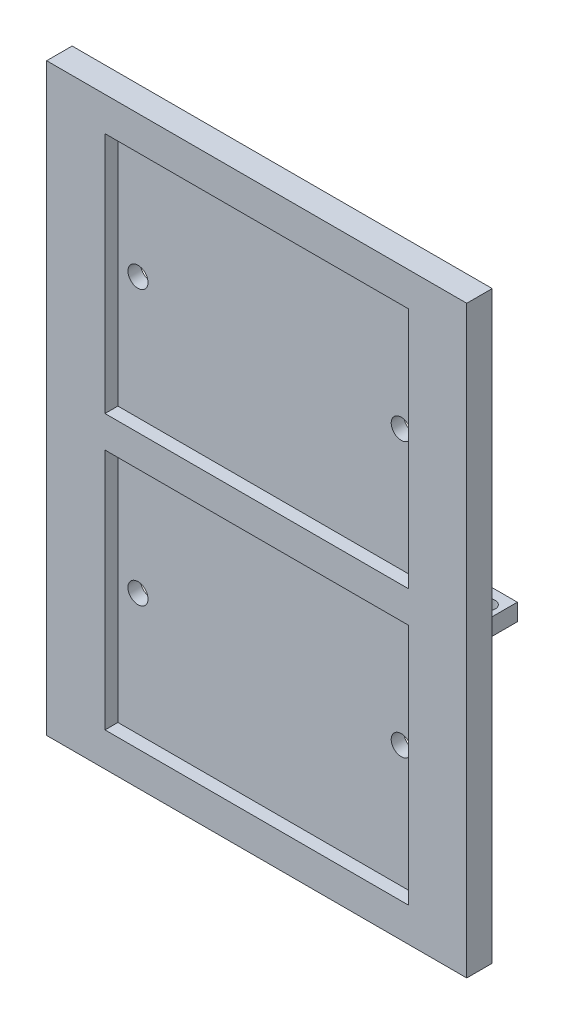
ISO-10303-21;
HEADER;
FILE_DESCRIPTION(('STEP AP214'),'2;1');
FILE_NAME('part.step','',(''),(''),'','','');
FILE_SCHEMA(('AUTOMOTIVE_DESIGN { 1 0 10303 214 1 1 1 1 }'));
ENDSEC;
DATA;
#1=APPLICATION_CONTEXT('core data for automotive mechanical design processes');
#2=APPLICATION_PROTOCOL_DEFINITION('international standard','automotive_design',2000,#1);
#3=PRODUCT_CONTEXT('',#1,'mechanical');
#4=PRODUCT('Part','Part','',(#3));
#5=PRODUCT_RELATED_PRODUCT_CATEGORY('part','',(#4));
#6=PRODUCT_DEFINITION_FORMATION('','',#4);
#7=PRODUCT_DEFINITION_CONTEXT('part definition',#1,'design');
#8=PRODUCT_DEFINITION('design','',#6,#7);
#9=PRODUCT_DEFINITION_SHAPE('','',#8);
#10=(LENGTH_UNIT() NAMED_UNIT(*) SI_UNIT(.MILLI.,.METRE.));
#11=(NAMED_UNIT(*) PLANE_ANGLE_UNIT() SI_UNIT($,.RADIAN.));
#12=(NAMED_UNIT(*) SI_UNIT($,.STERADIAN.) SOLID_ANGLE_UNIT());
#13=UNCERTAINTY_MEASURE_WITH_UNIT(LENGTH_MEASURE(1.E-05),#10,'distance_accuracy_value','');
#14=(GEOMETRIC_REPRESENTATION_CONTEXT(3) GLOBAL_UNCERTAINTY_ASSIGNED_CONTEXT((#13)) GLOBAL_UNIT_ASSIGNED_CONTEXT((#10,
#11,#12)) REPRESENTATION_CONTEXT('',''));
#15=CARTESIAN_POINT('',(0.,0.,0.));
#16=DIRECTION('',(0.,0.,1.));
#17=DIRECTION('',(1.,0.,0.));
#18=AXIS2_PLACEMENT_3D('',#15,#16,#17);
#19=CARTESIAN_POINT('',(0.,0.,-3.81));
#20=DIRECTION('',(0.,0.,1.));
#21=DIRECTION('',(1.,0.,0.));
#22=AXIS2_PLACEMENT_3D('',#19,#20,#21);
#23=PLANE('',#22);
#24=CARTESIAN_POINT('',(19.6822,20.608,-3.81));
#25=DIRECTION('',(0.,0.,1.));
#26=DIRECTION('',(1.,0.,0.));
#27=AXIS2_PLACEMENT_3D('',#24,#25,#26);
#28=CIRCLE('',#27,1.5);
#29=CARTESIAN_POINT('',(21.1822,20.608,-3.81));
#30=VERTEX_POINT('',#29);
#31=EDGE_CURVE('E715',#30,#30,#28,.T.);
#32=ORIENTED_EDGE('',*,*,#31,.T.);
#33=EDGE_LOOP('',(#32));
#34=FACE_BOUND('',#33,.T.);
#35=CARTESIAN_POINT('',(-19.6822,-20.3622,-3.81));
#36=DIRECTION('',(0.,0.,1.));
#37=DIRECTION('',(1.,0.,0.));
#38=AXIS2_PLACEMENT_3D('',#35,#36,#37);
#39=CIRCLE('',#38,1.5);
#40=CARTESIAN_POINT('',(-18.1822,-20.3622,-3.81));
#41=VERTEX_POINT('',#40);
#42=EDGE_CURVE('E207',#41,#41,#39,.T.);
#43=ORIENTED_EDGE('',*,*,#42,.T.);
#44=EDGE_LOOP('',(#43));
#45=FACE_BOUND('',#44,.T.);
#46=CARTESIAN_POINT('',(-19.6822,20.608,-3.81));
#47=DIRECTION('',(0.,0.,1.));
#48=DIRECTION('',(1.,0.,0.));
#49=AXIS2_PLACEMENT_3D('',#46,#47,#48);
#50=CIRCLE('',#49,1.5);
#51=CARTESIAN_POINT('',(-18.1822,20.608,-3.81));
#52=VERTEX_POINT('',#51);
#53=EDGE_CURVE('E719',#52,#52,#50,.T.);
#54=ORIENTED_EDGE('',*,*,#53,.T.);
#55=EDGE_LOOP('',(#54));
#56=FACE_BOUND('',#55,.T.);
#57=CARTESIAN_POINT('',(19.6822,-20.3622,-3.81));
#58=DIRECTION('',(0.,0.,1.));
#59=DIRECTION('',(1.,0.,0.));
#60=AXIS2_PLACEMENT_3D('',#57,#58,#59);
#61=CIRCLE('',#60,1.5);
#62=CARTESIAN_POINT('',(21.1822,-20.3622,-3.81));
#63=VERTEX_POINT('',#62);
#64=EDGE_CURVE('E712',#63,#63,#61,.T.);
#65=ORIENTED_EDGE('',*,*,#64,.T.);
#66=EDGE_LOOP('',(#65));
#67=FACE_BOUND('',#66,.T.);
#68=DIRECTION('',(0.,-1.,0.));
#69=VECTOR('',#68,1.);
#70=CARTESIAN_POINT('',(30.0853602,-0.126999999999988,-3.81));
#71=LINE('',#70,#69);
#72=CARTESIAN_POINT('',(30.0853602,-0.126999999999988,-3.81));
#73=VERTEX_POINT('',#72);
#74=CARTESIAN_POINT('',(30.0853602,-2.66699999999999,-3.81));
#75=VERTEX_POINT('',#74);
#76=EDGE_CURVE('E329',#73,#75,#71,.T.);
#77=ORIENTED_EDGE('',*,*,#76,.F.);
#78=DIRECTION('',(1.,0.,0.));
#79=VECTOR('',#78,1.);
#80=CARTESIAN_POINT('',(30.0853602,-0.126999999999988,-3.81));
#81=LINE('',#80,#79);
#82=CARTESIAN_POINT('',(26.2753602,-0.126999999999988,-3.81));
#83=VERTEX_POINT('',#82);
#84=EDGE_CURVE('E335',#83,#73,#81,.T.);
#85=ORIENTED_EDGE('',*,*,#84,.F.);
#86=DIRECTION('',(0.,1.,0.));
#87=VECTOR('',#86,1.);
#88=CARTESIAN_POINT('',(26.2753602,-0.126999999999988,-3.81));
#89=LINE('',#88,#87);
#90=CARTESIAN_POINT('',(26.2753602,-2.66699999999999,-3.81));
#91=VERTEX_POINT('',#90);
#92=EDGE_CURVE('E352',#91,#83,#89,.T.);
#93=ORIENTED_EDGE('',*,*,#92,.F.);
#94=DIRECTION('',(-1.,0.,0.));
#95=VECTOR('',#94,1.);
#96=CARTESIAN_POINT('',(30.0853602,-2.66699999999999,-3.81));
#97=LINE('',#96,#95);
#98=EDGE_CURVE('E348',#75,#91,#97,.T.);
#99=ORIENTED_EDGE('',*,*,#98,.F.);
#100=EDGE_LOOP('',(#77,#85,#93,#99));
#101=FACE_BOUND('',#100,.T.);
#102=DIRECTION('',(0.,-1.,0.));
#103=VECTOR('',#102,1.);
#104=CARTESIAN_POINT('',(-31.4071,43.688,-3.81));
#105=LINE('',#104,#103);
#106=CARTESIAN_POINT('',(-31.4071,43.688,-3.81));
#107=VERTEX_POINT('',#106);
#108=CARTESIAN_POINT('',(-31.4071,-43.688,-3.81));
#109=VERTEX_POINT('',#108);
#110=EDGE_CURVE('E375',#107,#109,#105,.T.);
#111=ORIENTED_EDGE('',*,*,#110,.F.);
#112=DIRECTION('',(-1.,0.,0.));
#113=VECTOR('',#112,1.);
#114=CARTESIAN_POINT('',(-31.4071,43.688,-3.81));
#115=LINE('',#114,#113);
#116=CARTESIAN_POINT('',(31.4071,43.688,-3.81));
#117=VERTEX_POINT('',#116);
#118=EDGE_CURVE('E388',#117,#107,#115,.T.);
#119=ORIENTED_EDGE('',*,*,#118,.F.);
#120=DIRECTION('',(0.,1.,0.));
#121=VECTOR('',#120,1.);
#122=CARTESIAN_POINT('',(31.4071,43.688,-3.81));
#123=LINE('',#122,#121);
#124=CARTESIAN_POINT('',(31.4071,-43.688,-3.81));
#125=VERTEX_POINT('',#124);
#126=EDGE_CURVE('E384',#125,#117,#123,.T.);
#127=ORIENTED_EDGE('',*,*,#126,.F.);
#128=DIRECTION('',(1.,0.,0.));
#129=VECTOR('',#128,1.);
#130=CARTESIAN_POINT('',(-31.4071,-43.688,-3.81));
#131=LINE('',#130,#129);
#132=EDGE_CURVE('E379',#109,#125,#131,.T.);
#133=ORIENTED_EDGE('',*,*,#132,.F.);
#134=EDGE_LOOP('',(#111,#119,#127,#133));
#135=FACE_BOUND('',#134,.T.);
#136=DIRECTION('',(0.,1.,0.));
#137=VECTOR('',#136,1.);
#138=CARTESIAN_POINT('',(-30.0853602,-0.126999999999981,-3.81));
#139=LINE('',#138,#137);
#140=CARTESIAN_POINT('',(-30.0853602,-2.66699999999998,-3.81));
#141=VERTEX_POINT('',#140);
#142=CARTESIAN_POINT('',(-30.0853602,-0.126999999999981,-3.81));
#143=VERTEX_POINT('',#142);
#144=EDGE_CURVE('E284',#141,#143,#139,.T.);
#145=ORIENTED_EDGE('',*,*,#144,.F.);
#146=DIRECTION('',(-1.,0.,0.));
#147=VECTOR('',#146,1.);
#148=CARTESIAN_POINT('',(-30.0853602,-2.66699999999998,-3.81));
#149=LINE('',#148,#147);
#150=CARTESIAN_POINT('',(-26.2753602,-2.66699999999998,-3.81));
#151=VERTEX_POINT('',#150);
#152=EDGE_CURVE('E290',#151,#141,#149,.T.);
#153=ORIENTED_EDGE('',*,*,#152,.F.);
#154=DIRECTION('',(0.,-1.,0.));
#155=VECTOR('',#154,1.);
#156=CARTESIAN_POINT('',(-26.2753602,-0.126999999999981,-3.81));
#157=LINE('',#156,#155);
#158=CARTESIAN_POINT('',(-26.2753602,-0.126999999999981,-3.81));
#159=VERTEX_POINT('',#158);
#160=EDGE_CURVE('E307',#159,#151,#157,.T.);
#161=ORIENTED_EDGE('',*,*,#160,.F.);
#162=DIRECTION('',(1.,0.,0.));
#163=VECTOR('',#162,1.);
#164=CARTESIAN_POINT('',(-30.0853602,-0.126999999999981,-3.81));
#165=LINE('',#164,#163);
#166=EDGE_CURVE('E303',#143,#159,#165,.T.);
#167=ORIENTED_EDGE('',*,*,#166,.F.);
#168=EDGE_LOOP('',(#145,#153,#161,#167));
#169=FACE_BOUND('',#168,.T.);
#170=ADVANCED_FACE('F38',(#34,#45,#56,#67,#101,#135,#169),#23,.F.);
#171=CARTESIAN_POINT('',(-31.4071,43.688,-3.81));
#172=DIRECTION('',(-1.,0.,0.));
#173=DIRECTION('',(0.,-1.,0.));
#174=AXIS2_PLACEMENT_3D('',#171,#172,#173);
#175=PLANE('',#174);
#176=DIRECTION('',(0.,-1.,0.));
#177=VECTOR('',#176,1.);
#178=CARTESIAN_POINT('',(-31.4071,43.688,0.));
#179=LINE('',#178,#177);
#180=CARTESIAN_POINT('',(-31.4071,43.688,0.));
#181=VERTEX_POINT('',#180);
#182=CARTESIAN_POINT('',(-31.4071,-43.688,0.));
#183=VERTEX_POINT('',#182);
#184=EDGE_CURVE('E374',#181,#183,#179,.T.);
#185=ORIENTED_EDGE('',*,*,#184,.F.);
#186=DIRECTION('',(0.,0.,1.));
#187=VECTOR('',#186,1.);
#188=CARTESIAN_POINT('',(-31.4071,43.688,-3.81));
#189=LINE('',#188,#187);
#190=EDGE_CURVE('E11',#107,#181,#189,.T.);
#191=ORIENTED_EDGE('',*,*,#190,.F.);
#192=ORIENTED_EDGE('',*,*,#110,.T.);
#193=DIRECTION('',(0.,0.,1.));
#194=VECTOR('',#193,1.);
#195=CARTESIAN_POINT('',(-31.4071,-43.688,-3.81));
#196=LINE('',#195,#194);
#197=EDGE_CURVE('E392',#109,#183,#196,.T.);
#198=ORIENTED_EDGE('',*,*,#197,.T.);
#199=EDGE_LOOP('',(#185,#191,#192,#198));
#200=FACE_BOUND('',#199,.T.);
#201=ADVANCED_FACE('F40',(#200),#175,.T.);
#202=CARTESIAN_POINT('',(-31.4071,43.688,-3.81));
#203=DIRECTION('',(0.,1.,0.));
#204=DIRECTION('',(-1.,0.,0.));
#205=AXIS2_PLACEMENT_3D('',#202,#203,#204);
#206=PLANE('',#205);
#207=DIRECTION('',(-1.,0.,0.));
#208=VECTOR('',#207,1.);
#209=CARTESIAN_POINT('',(-31.4071,43.688,0.));
#210=LINE('',#209,#208);
#211=CARTESIAN_POINT('',(31.4071,43.688,0.));
#212=VERTEX_POINT('',#211);
#213=EDGE_CURVE('E380',#212,#181,#210,.T.);
#214=ORIENTED_EDGE('',*,*,#213,.F.);
#215=DIRECTION('',(0.,0.,1.));
#216=VECTOR('',#215,1.);
#217=CARTESIAN_POINT('',(31.4071,43.688,-3.81));
#218=LINE('',#217,#216);
#219=EDGE_CURVE('E48',#117,#212,#218,.T.);
#220=ORIENTED_EDGE('',*,*,#219,.F.);
#221=ORIENTED_EDGE('',*,*,#118,.T.);
#222=ORIENTED_EDGE('',*,*,#190,.T.);
#223=EDGE_LOOP('',(#214,#220,#221,#222));
#224=FACE_BOUND('',#223,.T.);
#225=ADVANCED_FACE('F424',(#224),#206,.T.);
#226=CARTESIAN_POINT('',(31.4071,43.688,-3.81));
#227=DIRECTION('',(1.,0.,0.));
#228=DIRECTION('',(0.,1.,0.));
#229=AXIS2_PLACEMENT_3D('',#226,#227,#228);
#230=PLANE('',#229);
#231=DIRECTION('',(0.,1.,0.));
#232=VECTOR('',#231,1.);
#233=CARTESIAN_POINT('',(31.4071,43.688,0.));
#234=LINE('',#233,#232);
#235=CARTESIAN_POINT('',(31.4071,-43.688,0.));
#236=VERTEX_POINT('',#235);
#237=EDGE_CURVE('E400',#236,#212,#234,.T.);
#238=ORIENTED_EDGE('',*,*,#237,.F.);
#239=DIRECTION('',(0.,0.,1.));
#240=VECTOR('',#239,1.);
#241=CARTESIAN_POINT('',(31.4071,-43.688,-3.81));
#242=LINE('',#241,#240);
#243=EDGE_CURVE('E409',#125,#236,#242,.T.);
#244=ORIENTED_EDGE('',*,*,#243,.F.);
#245=ORIENTED_EDGE('',*,*,#126,.T.);
#246=ORIENTED_EDGE('',*,*,#219,.T.);
#247=EDGE_LOOP('',(#238,#244,#245,#246));
#248=FACE_BOUND('',#247,.T.);
#249=ADVANCED_FACE('F430',(#248),#230,.T.);
#250=CARTESIAN_POINT('',(-31.4071,-43.688,-3.81));
#251=DIRECTION('',(0.,-1.,0.));
#252=DIRECTION('',(0.,0.,-1.));
#253=AXIS2_PLACEMENT_3D('',#250,#251,#252);
#254=PLANE('',#253);
#255=DIRECTION('',(1.,0.,0.));
#256=VECTOR('',#255,1.);
#257=CARTESIAN_POINT('',(-31.4071,-43.688,0.));
#258=LINE('',#257,#256);
#259=EDGE_CURVE('E396',#183,#236,#258,.T.);
#260=ORIENTED_EDGE('',*,*,#259,.F.);
#261=ORIENTED_EDGE('',*,*,#197,.F.);
#262=ORIENTED_EDGE('',*,*,#132,.T.);
#263=ORIENTED_EDGE('',*,*,#243,.T.);
#264=EDGE_LOOP('',(#260,#261,#262,#263));
#265=FACE_BOUND('',#264,.T.);
#266=ADVANCED_FACE('F418',(#265),#254,.T.);
#267=CARTESIAN_POINT('',(0.,0.,0.));
#268=DIRECTION('',(0.,0.,1.));
#269=DIRECTION('',(1.,0.,0.));
#270=AXIS2_PLACEMENT_3D('',#267,#268,#269);
#271=PLANE('',#270);
#272=DIRECTION('',(-1.,0.,0.));
#273=VECTOR('',#272,1.);
#274=CARTESIAN_POINT('',(22.6822,38.608,0.));
#275=LINE('',#274,#273);
#276=CARTESIAN_POINT('',(22.6822,38.608,0.));
#277=VERTEX_POINT('',#276);
#278=CARTESIAN_POINT('',(-22.6822,38.608,0.));
#279=VERTEX_POINT('',#278);
#280=EDGE_CURVE('E56',#277,#279,#275,.T.);
#281=ORIENTED_EDGE('',*,*,#280,.F.);
#282=DIRECTION('',(0.,1.,0.));
#283=VECTOR('',#282,1.);
#284=CARTESIAN_POINT('',(22.6822,38.608,0.));
#285=LINE('',#284,#283);
#286=CARTESIAN_POINT('',(22.6822,2.3622,0.));
#287=VERTEX_POINT('',#286);
#288=EDGE_CURVE('E200',#287,#277,#285,.T.);
#289=ORIENTED_EDGE('',*,*,#288,.F.);
#290=DIRECTION('',(1.,0.,0.));
#291=VECTOR('',#290,1.);
#292=CARTESIAN_POINT('',(22.6822,2.3622,0.));
#293=LINE('',#292,#291);
#294=CARTESIAN_POINT('',(-22.6822,2.36219999999999,0.));
#295=VERTEX_POINT('',#294);
#296=EDGE_CURVE('E204',#295,#287,#293,.T.);
#297=ORIENTED_EDGE('',*,*,#296,.F.);
#298=DIRECTION('',(0.,-1.,0.));
#299=VECTOR('',#298,1.);
#300=CARTESIAN_POINT('',(-22.6822,38.608,0.));
#301=LINE('',#300,#299);
#302=EDGE_CURVE('E216',#279,#295,#301,.T.);
#303=ORIENTED_EDGE('',*,*,#302,.F.);
#304=EDGE_LOOP('',(#281,#289,#297,#303));
#305=FACE_BOUND('',#304,.T.);
#306=DIRECTION('',(1.,0.,0.));
#307=VECTOR('',#306,1.);
#308=CARTESIAN_POINT('',(22.6822,-38.608,0.));
#309=LINE('',#308,#307);
#310=CARTESIAN_POINT('',(-22.6822,-38.608,0.));
#311=VERTEX_POINT('',#310);
#312=CARTESIAN_POINT('',(22.6822,-38.608,0.));
#313=VERTEX_POINT('',#312);
#314=EDGE_CURVE('E64',#311,#313,#309,.T.);
#315=ORIENTED_EDGE('',*,*,#314,.F.);
#316=DIRECTION('',(0.,-1.,0.));
#317=VECTOR('',#316,1.);
#318=CARTESIAN_POINT('',(-22.6822,-38.608,0.));
#319=LINE('',#318,#317);
#320=CARTESIAN_POINT('',(-22.6822,-2.36219999999998,0.));
#321=VERTEX_POINT('',#320);
#322=EDGE_CURVE('E237',#321,#311,#319,.T.);
#323=ORIENTED_EDGE('',*,*,#322,.F.);
#324=DIRECTION('',(-1.,0.,0.));
#325=VECTOR('',#324,1.);
#326=CARTESIAN_POINT('',(22.6822,-2.36219999999999,0.));
#327=LINE('',#326,#325);
#328=CARTESIAN_POINT('',(22.6822,-2.36219999999999,0.));
#329=VERTEX_POINT('',#328);
#330=EDGE_CURVE('E256',#329,#321,#327,.T.);
#331=ORIENTED_EDGE('',*,*,#330,.F.);
#332=DIRECTION('',(0.,1.,0.));
#333=VECTOR('',#332,1.);
#334=CARTESIAN_POINT('',(22.6822,-38.608,0.));
#335=LINE('',#334,#333);
#336=EDGE_CURVE('E252',#313,#329,#335,.T.);
#337=ORIENTED_EDGE('',*,*,#336,.F.);
#338=EDGE_LOOP('',(#315,#323,#331,#337));
#339=FACE_BOUND('',#338,.T.);
#340=ORIENTED_EDGE('',*,*,#184,.T.);
#341=ORIENTED_EDGE('',*,*,#259,.T.);
#342=ORIENTED_EDGE('',*,*,#237,.T.);
#343=ORIENTED_EDGE('',*,*,#213,.T.);
#344=EDGE_LOOP('',(#340,#341,#342,#343));
#345=FACE_BOUND('',#344,.T.);
#346=ADVANCED_FACE('F421',(#305,#339,#345),#271,.T.);
#347=CARTESIAN_POINT('',(30.0853602,-0.126999999999988,-8.89));
#348=DIRECTION('',(-1.,0.,0.));
#349=DIRECTION('',(0.,0.,1.));
#350=AXIS2_PLACEMENT_3D('',#347,#348,#349);
#351=PLANE('',#350);
#352=ORIENTED_EDGE('',*,*,#76,.T.);
#353=DIRECTION('',(0.,0.,1.));
#354=VECTOR('',#353,1.);
#355=CARTESIAN_POINT('',(30.0853602,-2.66699999999999,-8.89));
#356=LINE('',#355,#354);
#357=CARTESIAN_POINT('',(30.0853602,-2.66699999999999,-8.89));
#358=VERTEX_POINT('',#357);
#359=EDGE_CURVE('E370',#358,#75,#356,.T.);
#360=ORIENTED_EDGE('',*,*,#359,.F.);
#361=DIRECTION('',(0.,-1.,0.));
#362=VECTOR('',#361,1.);
#363=CARTESIAN_POINT('',(30.0853602,-0.126999999999988,-8.89));
#364=LINE('',#363,#362);
#365=CARTESIAN_POINT('',(30.0853602,-0.126999999999988,-8.89));
#366=VERTEX_POINT('',#365);
#367=EDGE_CURVE('E330',#366,#358,#364,.T.);
#368=ORIENTED_EDGE('',*,*,#367,.F.);
#369=DIRECTION('',(0.,0.,1.));
#370=VECTOR('',#369,1.);
#371=CARTESIAN_POINT('',(30.0853602,-0.126999999999988,-8.89));
#372=LINE('',#371,#370);
#373=EDGE_CURVE('E344',#366,#73,#372,.T.);
#374=ORIENTED_EDGE('',*,*,#373,.T.);
#375=EDGE_LOOP('',(#352,#360,#368,#374));
#376=FACE_BOUND('',#375,.T.);
#377=ADVANCED_FACE('F448',(#376),#351,.F.);
#378=CARTESIAN_POINT('',(30.0853602,-2.66699999999999,-8.89));
#379=DIRECTION('',(0.,1.,0.));
#380=DIRECTION('',(0.,0.,1.));
#381=AXIS2_PLACEMENT_3D('',#378,#379,#380);
#382=PLANE('',#381);
#383=CARTESIAN_POINT('',(28.1803602,-2.66699999999999,-6.35));
#384=DIRECTION('',(0.,1.,0.));
#385=DIRECTION('',(0.,0.,1.));
#386=AXIS2_PLACEMENT_3D('',#383,#384,#385);
#387=CIRCLE('',#386,1.1303);
#388=CARTESIAN_POINT('',(28.1803602,-2.66699999999999,-5.2197));
#389=VERTEX_POINT('',#388);
#390=EDGE_CURVE('E280',#389,#389,#387,.T.);
#391=ORIENTED_EDGE('',*,*,#390,.T.);
#392=EDGE_LOOP('',(#391));
#393=FACE_BOUND('',#392,.T.);
#394=ORIENTED_EDGE('',*,*,#98,.T.);
#395=DIRECTION('',(0.,0.,1.));
#396=VECTOR('',#395,1.);
#397=CARTESIAN_POINT('',(26.2753602,-2.66699999999999,-8.89));
#398=LINE('',#397,#396);
#399=CARTESIAN_POINT('',(26.2753602,-2.66699999999999,-8.89));
#400=VERTEX_POINT('',#399);
#401=EDGE_CURVE('E366',#400,#91,#398,.T.);
#402=ORIENTED_EDGE('',*,*,#401,.F.);
#403=DIRECTION('',(-1.,0.,0.));
#404=VECTOR('',#403,1.);
#405=CARTESIAN_POINT('',(30.0853602,-2.66699999999999,-8.89));
#406=LINE('',#405,#404);
#407=EDGE_CURVE('E334',#358,#400,#406,.T.);
#408=ORIENTED_EDGE('',*,*,#407,.F.);
#409=ORIENTED_EDGE('',*,*,#359,.T.);
#410=EDGE_LOOP('',(#394,#402,#408,#409));
#411=FACE_BOUND('',#410,.T.);
#412=ADVANCED_FACE('F455',(#393,#411),#382,.F.);
#413=CARTESIAN_POINT('',(26.2753602,-0.126999999999988,-8.89));
#414=DIRECTION('',(1.,0.,0.));
#415=DIRECTION('',(0.,0.,-1.));
#416=AXIS2_PLACEMENT_3D('',#413,#414,#415);
#417=PLANE('',#416);
#418=ORIENTED_EDGE('',*,*,#92,.T.);
#419=DIRECTION('',(0.,0.,1.));
#420=VECTOR('',#419,1.);
#421=CARTESIAN_POINT('',(26.2753602,-0.126999999999988,-8.89));
#422=LINE('',#421,#420);
#423=CARTESIAN_POINT('',(26.2753602,-0.126999999999988,-8.89));
#424=VERTEX_POINT('',#423);
#425=EDGE_CURVE('E362',#424,#83,#422,.T.);
#426=ORIENTED_EDGE('',*,*,#425,.F.);
#427=DIRECTION('',(0.,1.,0.));
#428=VECTOR('',#427,1.);
#429=CARTESIAN_POINT('',(26.2753602,-0.126999999999988,-8.89));
#430=LINE('',#429,#428);
#431=EDGE_CURVE('E338',#400,#424,#430,.T.);
#432=ORIENTED_EDGE('',*,*,#431,.F.);
#433=ORIENTED_EDGE('',*,*,#401,.T.);
#434=EDGE_LOOP('',(#418,#426,#432,#433));
#435=FACE_BOUND('',#434,.T.);
#436=ADVANCED_FACE('F522',(#435),#417,.F.);
#437=CARTESIAN_POINT('',(30.0853602,-0.126999999999988,-8.89));
#438=DIRECTION('',(0.,-1.,0.));
#439=DIRECTION('',(0.,0.,-1.));
#440=AXIS2_PLACEMENT_3D('',#437,#438,#439);
#441=PLANE('',#440);
#442=CARTESIAN_POINT('',(28.1803602,-0.126999999999985,-6.35));
#443=DIRECTION('',(0.,1.,0.));
#444=DIRECTION('',(-1.,0.,0.));
#445=AXIS2_PLACEMENT_3D('',#442,#443,#444);
#446=CIRCLE('',#445,1.1303);
#447=CARTESIAN_POINT('',(27.0500602,-0.126999999999985,-6.35));
#448=VERTEX_POINT('',#447);
#449=EDGE_CURVE('E273',#448,#448,#446,.T.);
#450=ORIENTED_EDGE('',*,*,#449,.F.);
#451=EDGE_LOOP('',(#450));
#452=FACE_BOUND('',#451,.T.);
#453=ORIENTED_EDGE('',*,*,#84,.T.);
#454=ORIENTED_EDGE('',*,*,#373,.F.);
#455=DIRECTION('',(1.,0.,0.));
#456=VECTOR('',#455,1.);
#457=CARTESIAN_POINT('',(30.0853602,-0.126999999999988,-8.89));
#458=LINE('',#457,#456);
#459=EDGE_CURVE('E341',#424,#366,#458,.T.);
#460=ORIENTED_EDGE('',*,*,#459,.F.);
#461=ORIENTED_EDGE('',*,*,#425,.T.);
#462=EDGE_LOOP('',(#453,#454,#460,#461));
#463=FACE_BOUND('',#462,.T.);
#464=ADVANCED_FACE('F518',(#452,#463),#441,.F.);
#465=CARTESIAN_POINT('',(0.,0.,-8.89));
#466=DIRECTION('',(0.,0.,-1.));
#467=DIRECTION('',(-1.,0.,0.));
#468=AXIS2_PLACEMENT_3D('',#465,#466,#467);
#469=PLANE('',#468);
#470=ORIENTED_EDGE('',*,*,#367,.T.);
#471=ORIENTED_EDGE('',*,*,#407,.T.);
#472=ORIENTED_EDGE('',*,*,#431,.T.);
#473=ORIENTED_EDGE('',*,*,#459,.T.);
#474=EDGE_LOOP('',(#470,#471,#472,#473));
#475=FACE_BOUND('',#474,.T.);
#476=ADVANCED_FACE('F514',(#475),#469,.T.);
#477=CARTESIAN_POINT('',(-30.0853602,-0.126999999999981,-8.89));
#478=DIRECTION('',(1.,0.,0.));
#479=DIRECTION('',(0.,0.,-1.));
#480=AXIS2_PLACEMENT_3D('',#477,#478,#479);
#481=PLANE('',#480);
#482=ORIENTED_EDGE('',*,*,#144,.T.);
#483=DIRECTION('',(0.,0.,1.));
#484=VECTOR('',#483,1.);
#485=CARTESIAN_POINT('',(-30.0853602,-0.126999999999981,-8.89));
#486=LINE('',#485,#484);
#487=CARTESIAN_POINT('',(-30.0853602,-0.126999999999981,-8.89));
#488=VERTEX_POINT('',#487);
#489=EDGE_CURVE('E325',#488,#143,#486,.T.);
#490=ORIENTED_EDGE('',*,*,#489,.F.);
#491=DIRECTION('',(0.,1.,0.));
#492=VECTOR('',#491,1.);
#493=CARTESIAN_POINT('',(-30.0853602,-0.126999999999981,-8.89));
#494=LINE('',#493,#492);
#495=CARTESIAN_POINT('',(-30.0853602,-2.66699999999998,-8.89));
#496=VERTEX_POINT('',#495);
#497=EDGE_CURVE('E285',#496,#488,#494,.T.);
#498=ORIENTED_EDGE('',*,*,#497,.F.);
#499=DIRECTION('',(0.,0.,1.));
#500=VECTOR('',#499,1.);
#501=CARTESIAN_POINT('',(-30.0853602,-2.66699999999998,-8.89));
#502=LINE('',#501,#500);
#503=EDGE_CURVE('E299',#496,#141,#502,.T.);
#504=ORIENTED_EDGE('',*,*,#503,.T.);
#505=EDGE_LOOP('',(#482,#490,#498,#504));
#506=FACE_BOUND('',#505,.T.);
#507=ADVANCED_FACE('F510',(#506),#481,.F.);
#508=CARTESIAN_POINT('',(-30.0853602,-0.126999999999981,-8.89));
#509=DIRECTION('',(0.,-1.,0.));
#510=DIRECTION('',(0.,0.,-1.));
#511=AXIS2_PLACEMENT_3D('',#508,#509,#510);
#512=PLANE('',#511);
#513=CARTESIAN_POINT('',(-28.3626086274617,-0.126999999999991,-6.35));
#514=DIRECTION('',(0.,1.,0.));
#515=DIRECTION('',(-1.,0.,0.));
#516=AXIS2_PLACEMENT_3D('',#513,#514,#515);
#517=CIRCLE('',#516,1.1303);
#518=CARTESIAN_POINT('',(-29.4929086274617,-0.126999999999992,-6.35));
#519=VERTEX_POINT('',#518);
#520=EDGE_CURVE('E226',#519,#519,#517,.T.);
#521=ORIENTED_EDGE('',*,*,#520,.F.);
#522=EDGE_LOOP('',(#521));
#523=FACE_BOUND('',#522,.T.);
#524=ORIENTED_EDGE('',*,*,#166,.T.);
#525=DIRECTION('',(0.,0.,1.));
#526=VECTOR('',#525,1.);
#527=CARTESIAN_POINT('',(-26.2753602,-0.126999999999981,-8.89));
#528=LINE('',#527,#526);
#529=CARTESIAN_POINT('',(-26.2753602,-0.126999999999981,-8.89));
#530=VERTEX_POINT('',#529);
#531=EDGE_CURVE('E321',#530,#159,#528,.T.);
#532=ORIENTED_EDGE('',*,*,#531,.F.);
#533=DIRECTION('',(1.,0.,0.));
#534=VECTOR('',#533,1.);
#535=CARTESIAN_POINT('',(-30.0853602,-0.126999999999981,-8.89));
#536=LINE('',#535,#534);
#537=EDGE_CURVE('E289',#488,#530,#536,.T.);
#538=ORIENTED_EDGE('',*,*,#537,.F.);
#539=ORIENTED_EDGE('',*,*,#489,.T.);
#540=EDGE_LOOP('',(#524,#532,#538,#539));
#541=FACE_BOUND('',#540,.T.);
#542=ADVANCED_FACE('F506',(#523,#541),#512,.F.);
#543=CARTESIAN_POINT('',(-26.2753602,-0.126999999999981,-8.89));
#544=DIRECTION('',(-1.,0.,0.));
#545=DIRECTION('',(0.,0.,1.));
#546=AXIS2_PLACEMENT_3D('',#543,#544,#545);
#547=PLANE('',#546);
#548=ORIENTED_EDGE('',*,*,#160,.T.);
#549=DIRECTION('',(0.,0.,1.));
#550=VECTOR('',#549,1.);
#551=CARTESIAN_POINT('',(-26.2753602,-2.66699999999998,-8.89));
#552=LINE('',#551,#550);
#553=CARTESIAN_POINT('',(-26.2753602,-2.66699999999998,-8.89));
#554=VERTEX_POINT('',#553);
#555=EDGE_CURVE('E317',#554,#151,#552,.T.);
#556=ORIENTED_EDGE('',*,*,#555,.F.);
#557=DIRECTION('',(0.,-1.,0.));
#558=VECTOR('',#557,1.);
#559=CARTESIAN_POINT('',(-26.2753602,-0.126999999999981,-8.89));
#560=LINE('',#559,#558);
#561=EDGE_CURVE('E293',#530,#554,#560,.T.);
#562=ORIENTED_EDGE('',*,*,#561,.F.);
#563=ORIENTED_EDGE('',*,*,#531,.T.);
#564=EDGE_LOOP('',(#548,#556,#562,#563));
#565=FACE_BOUND('',#564,.T.);
#566=ADVANCED_FACE('F502',(#565),#547,.F.);
#567=CARTESIAN_POINT('',(-30.0853602,-2.66699999999998,-8.89));
#568=DIRECTION('',(0.,1.,0.));
#569=DIRECTION('',(0.,0.,1.));
#570=AXIS2_PLACEMENT_3D('',#567,#568,#569);
#571=PLANE('',#570);
#572=CARTESIAN_POINT('',(-28.3626086274617,-2.66699999999998,-6.35));
#573=DIRECTION('',(0.,1.,0.));
#574=DIRECTION('',(0.,0.,1.));
#575=AXIS2_PLACEMENT_3D('',#572,#573,#574);
#576=CIRCLE('',#575,1.1303);
#577=CARTESIAN_POINT('',(-28.3626086274617,-2.66699999999998,-5.2197));
#578=VERTEX_POINT('',#577);
#579=EDGE_CURVE('E42',#578,#578,#576,.T.);
#580=ORIENTED_EDGE('',*,*,#579,.T.);
#581=EDGE_LOOP('',(#580));
#582=FACE_BOUND('',#581,.T.);
#583=ORIENTED_EDGE('',*,*,#152,.T.);
#584=ORIENTED_EDGE('',*,*,#503,.F.);
#585=DIRECTION('',(-1.,0.,0.));
#586=VECTOR('',#585,1.);
#587=CARTESIAN_POINT('',(-30.0853602,-2.66699999999998,-8.89));
#588=LINE('',#587,#586);
#589=EDGE_CURVE('E296',#554,#496,#588,.T.);
#590=ORIENTED_EDGE('',*,*,#589,.F.);
#591=ORIENTED_EDGE('',*,*,#555,.T.);
#592=EDGE_LOOP('',(#583,#584,#590,#591));
#593=FACE_BOUND('',#592,.T.);
#594=ADVANCED_FACE('F498',(#582,#593),#571,.F.);
#595=CARTESIAN_POINT('',(0.,0.,-8.89));
#596=DIRECTION('',(0.,0.,1.));
#597=DIRECTION('',(1.,0.,0.));
#598=AXIS2_PLACEMENT_3D('',#595,#596,#597);
#599=PLANE('',#598);
#600=ORIENTED_EDGE('',*,*,#497,.T.);
#601=ORIENTED_EDGE('',*,*,#537,.T.);
#602=ORIENTED_EDGE('',*,*,#561,.T.);
#603=ORIENTED_EDGE('',*,*,#589,.T.);
#604=EDGE_LOOP('',(#600,#601,#602,#603));
#605=FACE_BOUND('',#604,.T.);
#606=ADVANCED_FACE('F494',(#605),#599,.F.);
#607=CARTESIAN_POINT('',(-28.3626086274617,-5.20699999999999,-6.35));
#608=DIRECTION('',(0.,1.,0.));
#609=DIRECTION('',(-1.,0.,0.));
#610=AXIS2_PLACEMENT_3D('',#607,#608,#609);
#611=CYLINDRICAL_SURFACE('',#610,1.1303);
#612=ORIENTED_EDGE('',*,*,#520,.T.);
#613=EDGE_LOOP('',(#612));
#614=FACE_BOUND('',#613,.T.);
#615=ORIENTED_EDGE('',*,*,#579,.F.);
#616=EDGE_LOOP('',(#615));
#617=FACE_BOUND('',#616,.T.);
#618=ADVANCED_FACE('F490',(#614,#617),#611,.F.);
#619=CARTESIAN_POINT('',(28.1803602,-5.20699999999998,-6.35));
#620=DIRECTION('',(0.,1.,0.));
#621=DIRECTION('',(-1.,0.,0.));
#622=AXIS2_PLACEMENT_3D('',#619,#620,#621);
#623=CYLINDRICAL_SURFACE('',#622,1.1303);
#624=ORIENTED_EDGE('',*,*,#449,.T.);
#625=EDGE_LOOP('',(#624));
#626=FACE_BOUND('',#625,.T.);
#627=ORIENTED_EDGE('',*,*,#390,.F.);
#628=EDGE_LOOP('',(#627));
#629=FACE_BOUND('',#628,.T.);
#630=ADVANCED_FACE('F487',(#626,#629),#623,.F.);
#631=CARTESIAN_POINT('',(22.6822,-38.608,-1.9304));
#632=DIRECTION('',(0.,-1.,0.));
#633=DIRECTION('',(1.,0.,0.));
#634=AXIS2_PLACEMENT_3D('',#631,#632,#633);
#635=PLANE('',#634);
#636=ORIENTED_EDGE('',*,*,#314,.T.);
#637=DIRECTION('',(0.,0.,1.));
#638=VECTOR('',#637,1.);
#639=CARTESIAN_POINT('',(22.6822,-38.608,-1.9304));
#640=LINE('',#639,#638);
#641=CARTESIAN_POINT('',(22.6822,-38.608,-1.9304));
#642=VERTEX_POINT('',#641);
#643=EDGE_CURVE('E249',#642,#313,#640,.T.);
#644=ORIENTED_EDGE('',*,*,#643,.F.);
#645=DIRECTION('',(1.,0.,0.));
#646=VECTOR('',#645,1.);
#647=CARTESIAN_POINT('',(22.6822,-38.608,-1.9304));
#648=LINE('',#647,#646);
#649=CARTESIAN_POINT('',(-22.6822,-38.608,-1.9304));
#650=VERTEX_POINT('',#649);
#651=EDGE_CURVE('E232',#650,#642,#648,.T.);
#652=ORIENTED_EDGE('',*,*,#651,.F.);
#653=DIRECTION('',(0.,0.,1.));
#654=VECTOR('',#653,1.);
#655=CARTESIAN_POINT('',(-22.6822,-38.608,-1.9304));
#656=LINE('',#655,#654);
#657=EDGE_CURVE('E217',#650,#311,#656,.T.);
#658=ORIENTED_EDGE('',*,*,#657,.T.);
#659=EDGE_LOOP('',(#636,#644,#652,#658));
#660=FACE_BOUND('',#659,.T.);
#661=ADVANCED_FACE('F467',(#660),#635,.F.);
#662=CARTESIAN_POINT('',(-22.6822,-38.608,-1.9304));
#663=DIRECTION('',(-1.,0.,0.));
#664=DIRECTION('',(0.,-1.,0.));
#665=AXIS2_PLACEMENT_3D('',#662,#663,#664);
#666=PLANE('',#665);
#667=ORIENTED_EDGE('',*,*,#322,.T.);
#668=ORIENTED_EDGE('',*,*,#657,.F.);
#669=DIRECTION('',(0.,-1.,0.));
#670=VECTOR('',#669,1.);
#671=CARTESIAN_POINT('',(-22.6822,-38.608,-1.9304));
#672=LINE('',#671,#670);
#673=CARTESIAN_POINT('',(-22.6822,-2.36219999999998,-1.9304));
#674=VERTEX_POINT('',#673);
#675=EDGE_CURVE('E245',#674,#650,#672,.T.);
#676=ORIENTED_EDGE('',*,*,#675,.F.);
#677=DIRECTION('',(0.,0.,1.));
#678=VECTOR('',#677,1.);
#679=CARTESIAN_POINT('',(-22.6822,-2.36219999999998,-1.9304));
#680=LINE('',#679,#678);
#681=EDGE_CURVE('E265',#674,#321,#680,.T.);
#682=ORIENTED_EDGE('',*,*,#681,.T.);
#683=EDGE_LOOP('',(#667,#668,#676,#682));
#684=FACE_BOUND('',#683,.T.);
#685=ADVANCED_FACE('F472',(#684),#666,.F.);
#686=CARTESIAN_POINT('',(22.6822,-2.36219999999999,-1.9304));
#687=DIRECTION('',(0.,1.,0.));
#688=DIRECTION('',(-1.,0.,0.));
#689=AXIS2_PLACEMENT_3D('',#686,#687,#688);
#690=PLANE('',#689);
#691=ORIENTED_EDGE('',*,*,#330,.T.);
#692=ORIENTED_EDGE('',*,*,#681,.F.);
#693=DIRECTION('',(-1.,0.,0.));
#694=VECTOR('',#693,1.);
#695=CARTESIAN_POINT('',(22.6822,-2.36219999999999,-1.9304));
#696=LINE('',#695,#694);
#697=CARTESIAN_POINT('',(22.6822,-2.36219999999999,-1.9304));
#698=VERTEX_POINT('',#697);
#699=EDGE_CURVE('E241',#698,#674,#696,.T.);
#700=ORIENTED_EDGE('',*,*,#699,.F.);
#701=DIRECTION('',(0.,0.,1.));
#702=VECTOR('',#701,1.);
#703=CARTESIAN_POINT('',(22.6822,-2.36219999999999,-1.9304));
#704=LINE('',#703,#702);
#705=EDGE_CURVE('E268',#698,#329,#704,.T.);
#706=ORIENTED_EDGE('',*,*,#705,.T.);
#707=EDGE_LOOP('',(#691,#692,#700,#706));
#708=FACE_BOUND('',#707,.T.);
#709=ADVANCED_FACE('F474',(#708),#690,.F.);
#710=CARTESIAN_POINT('',(22.6822,-38.608,-1.9304));
#711=DIRECTION('',(1.,0.,0.));
#712=DIRECTION('',(0.,1.,0.));
#713=AXIS2_PLACEMENT_3D('',#710,#711,#712);
#714=PLANE('',#713);
#715=ORIENTED_EDGE('',*,*,#336,.T.);
#716=ORIENTED_EDGE('',*,*,#705,.F.);
#717=DIRECTION('',(0.,1.,0.));
#718=VECTOR('',#717,1.);
#719=CARTESIAN_POINT('',(22.6822,-38.608,-1.9304));
#720=LINE('',#719,#718);
#721=EDGE_CURVE('E236',#642,#698,#720,.T.);
#722=ORIENTED_EDGE('',*,*,#721,.F.);
#723=ORIENTED_EDGE('',*,*,#643,.T.);
#724=EDGE_LOOP('',(#715,#716,#722,#723));
#725=FACE_BOUND('',#724,.T.);
#726=ADVANCED_FACE('F463',(#725),#714,.F.);
#727=CARTESIAN_POINT('',(0.,0.,-1.9304));
#728=DIRECTION('',(0.,0.,-1.));
#729=DIRECTION('',(-1.,0.,0.));
#730=AXIS2_PLACEMENT_3D('',#727,#728,#729);
#731=PLANE('',#730);
#732=CARTESIAN_POINT('',(-19.6822,-20.3622,-1.9304));
#733=DIRECTION('',(0.,0.,1.));
#734=DIRECTION('',(-1.,0.,0.));
#735=AXIS2_PLACEMENT_3D('',#732,#733,#734);
#736=CIRCLE('',#735,1.5);
#737=CARTESIAN_POINT('',(-21.1822,-20.3622,-1.9304));
#738=VERTEX_POINT('',#737);
#739=EDGE_CURVE('E708',#738,#738,#736,.T.);
#740=ORIENTED_EDGE('',*,*,#739,.F.);
#741=EDGE_LOOP('',(#740));
#742=FACE_BOUND('',#741,.T.);
#743=CARTESIAN_POINT('',(19.6822,-20.3622,-1.9304));
#744=DIRECTION('',(0.,0.,1.));
#745=DIRECTION('',(1.,0.,0.));
#746=AXIS2_PLACEMENT_3D('',#743,#744,#745);
#747=CIRCLE('',#746,1.5);
#748=CARTESIAN_POINT('',(21.1822,-20.3622,-1.9304));
#749=VERTEX_POINT('',#748);
#750=EDGE_CURVE('E725',#749,#749,#747,.T.);
#751=ORIENTED_EDGE('',*,*,#750,.F.);
#752=EDGE_LOOP('',(#751));
#753=FACE_BOUND('',#752,.T.);
#754=ORIENTED_EDGE('',*,*,#651,.T.);
#755=ORIENTED_EDGE('',*,*,#721,.T.);
#756=ORIENTED_EDGE('',*,*,#699,.T.);
#757=ORIENTED_EDGE('',*,*,#675,.T.);
#758=EDGE_LOOP('',(#754,#755,#756,#757));
#759=FACE_BOUND('',#758,.T.);
#760=ADVANCED_FACE('F470',(#742,#753,#759),#731,.F.);
#761=CARTESIAN_POINT('',(22.6822,38.608,-1.9304));
#762=DIRECTION('',(0.,1.,0.));
#763=DIRECTION('',(-1.,0.,0.));
#764=AXIS2_PLACEMENT_3D('',#761,#762,#763);
#765=PLANE('',#764);
#766=ORIENTED_EDGE('',*,*,#280,.T.);
#767=DIRECTION('',(0.,0.,1.));
#768=VECTOR('',#767,1.);
#769=CARTESIAN_POINT('',(-22.6822,38.608,-1.9304));
#770=LINE('',#769,#768);
#771=CARTESIAN_POINT('',(-22.6822,38.608,-1.9304));
#772=VERTEX_POINT('',#771);
#773=EDGE_CURVE('E175',#772,#279,#770,.T.);
#774=ORIENTED_EDGE('',*,*,#773,.F.);
#775=DIRECTION('',(-1.,0.,0.));
#776=VECTOR('',#775,1.);
#777=CARTESIAN_POINT('',(22.6822,38.608,-1.9304));
#778=LINE('',#777,#776);
#779=CARTESIAN_POINT('',(22.6822,38.608,-1.9304));
#780=VERTEX_POINT('',#779);
#781=EDGE_CURVE('E179',#780,#772,#778,.T.);
#782=ORIENTED_EDGE('',*,*,#781,.F.);
#783=DIRECTION('',(0.,0.,1.));
#784=VECTOR('',#783,1.);
#785=CARTESIAN_POINT('',(22.6822,38.608,-1.9304));
#786=LINE('',#785,#784);
#787=EDGE_CURVE('E223',#780,#277,#786,.T.);
#788=ORIENTED_EDGE('',*,*,#787,.T.);
#789=EDGE_LOOP('',(#766,#774,#782,#788));
#790=FACE_BOUND('',#789,.T.);
#791=ADVANCED_FACE('F177',(#790),#765,.F.);
#792=CARTESIAN_POINT('',(22.6822,38.608,-1.9304));
#793=DIRECTION('',(1.,0.,0.));
#794=DIRECTION('',(0.,1.,0.));
#795=AXIS2_PLACEMENT_3D('',#792,#793,#794);
#796=PLANE('',#795);
#797=ORIENTED_EDGE('',*,*,#288,.T.);
#798=ORIENTED_EDGE('',*,*,#787,.F.);
#799=DIRECTION('',(0.,1.,0.));
#800=VECTOR('',#799,1.);
#801=CARTESIAN_POINT('',(22.6822,38.608,-1.9304));
#802=LINE('',#801,#800);
#803=CARTESIAN_POINT('',(22.6822,2.3622,-1.9304));
#804=VERTEX_POINT('',#803);
#805=EDGE_CURVE('E186',#804,#780,#802,.T.);
#806=ORIENTED_EDGE('',*,*,#805,.F.);
#807=DIRECTION('',(0.,0.,1.));
#808=VECTOR('',#807,1.);
#809=CARTESIAN_POINT('',(22.6822,2.3622,-1.9304));
#810=LINE('',#809,#808);
#811=EDGE_CURVE('E227',#804,#287,#810,.T.);
#812=ORIENTED_EDGE('',*,*,#811,.T.);
#813=EDGE_LOOP('',(#797,#798,#806,#812));
#814=FACE_BOUND('',#813,.T.);
#815=ADVANCED_FACE('F613',(#814),#796,.F.);
#816=CARTESIAN_POINT('',(22.6822,2.3622,-1.9304));
#817=DIRECTION('',(0.,-1.,0.));
#818=DIRECTION('',(1.,0.,0.));
#819=AXIS2_PLACEMENT_3D('',#816,#817,#818);
#820=PLANE('',#819);
#821=ORIENTED_EDGE('',*,*,#296,.T.);
#822=ORIENTED_EDGE('',*,*,#811,.F.);
#823=DIRECTION('',(1.,0.,0.));
#824=VECTOR('',#823,1.);
#825=CARTESIAN_POINT('',(22.6822,2.3622,-1.9304));
#826=LINE('',#825,#824);
#827=CARTESIAN_POINT('',(-22.6822,2.36219999999999,-1.9304));
#828=VERTEX_POINT('',#827);
#829=EDGE_CURVE('E195',#828,#804,#826,.T.);
#830=ORIENTED_EDGE('',*,*,#829,.F.);
#831=DIRECTION('',(0.,0.,1.));
#832=VECTOR('',#831,1.);
#833=CARTESIAN_POINT('',(-22.6822,2.36219999999999,-1.9304));
#834=LINE('',#833,#832);
#835=EDGE_CURVE('E185',#828,#295,#834,.T.);
#836=ORIENTED_EDGE('',*,*,#835,.T.);
#837=EDGE_LOOP('',(#821,#822,#830,#836));
#838=FACE_BOUND('',#837,.T.);
#839=ADVANCED_FACE('F622',(#838),#820,.F.);
#840=CARTESIAN_POINT('',(-22.6822,38.608,-1.9304));
#841=DIRECTION('',(-1.,0.,0.));
#842=DIRECTION('',(0.,-1.,0.));
#843=AXIS2_PLACEMENT_3D('',#840,#841,#842);
#844=PLANE('',#843);
#845=ORIENTED_EDGE('',*,*,#302,.T.);
#846=ORIENTED_EDGE('',*,*,#835,.F.);
#847=DIRECTION('',(0.,-1.,0.));
#848=VECTOR('',#847,1.);
#849=CARTESIAN_POINT('',(-22.6822,38.608,-1.9304));
#850=LINE('',#849,#848);
#851=EDGE_CURVE('E189',#772,#828,#850,.T.);
#852=ORIENTED_EDGE('',*,*,#851,.F.);
#853=ORIENTED_EDGE('',*,*,#773,.T.);
#854=EDGE_LOOP('',(#845,#846,#852,#853));
#855=FACE_BOUND('',#854,.T.);
#856=ADVANCED_FACE('F190',(#855),#844,.F.);
#857=CARTESIAN_POINT('',(0.,0.,-1.9304));
#858=DIRECTION('',(0.,0.,1.));
#859=DIRECTION('',(1.,0.,0.));
#860=AXIS2_PLACEMENT_3D('',#857,#858,#859);
#861=PLANE('',#860);
#862=CARTESIAN_POINT('',(19.6822,20.608,-1.9304));
#863=DIRECTION('',(0.,0.,1.));
#864=DIRECTION('',(1.,0.,0.));
#865=AXIS2_PLACEMENT_3D('',#862,#863,#864);
#866=CIRCLE('',#865,1.5);
#867=CARTESIAN_POINT('',(21.1822,20.608,-1.9304));
#868=VERTEX_POINT('',#867);
#869=EDGE_CURVE('E729',#868,#868,#866,.T.);
#870=ORIENTED_EDGE('',*,*,#869,.F.);
#871=EDGE_LOOP('',(#870));
#872=FACE_BOUND('',#871,.T.);
#873=CARTESIAN_POINT('',(-19.6822,20.608,-1.9304));
#874=DIRECTION('',(0.,0.,1.));
#875=DIRECTION('',(-1.,0.,0.));
#876=AXIS2_PLACEMENT_3D('',#873,#874,#875);
#877=CIRCLE('',#876,1.5);
#878=CARTESIAN_POINT('',(-21.1822,20.608,-1.9304));
#879=VERTEX_POINT('',#878);
#880=EDGE_CURVE('E732',#879,#879,#877,.T.);
#881=ORIENTED_EDGE('',*,*,#880,.F.);
#882=EDGE_LOOP('',(#881));
#883=FACE_BOUND('',#882,.T.);
#884=ORIENTED_EDGE('',*,*,#781,.T.);
#885=ORIENTED_EDGE('',*,*,#851,.T.);
#886=ORIENTED_EDGE('',*,*,#829,.T.);
#887=ORIENTED_EDGE('',*,*,#805,.T.);
#888=EDGE_LOOP('',(#884,#885,#886,#887));
#889=FACE_BOUND('',#888,.T.);
#890=ADVANCED_FACE('F197',(#872,#883,#889),#861,.T.);
#891=CARTESIAN_POINT('',(-19.6822,20.608,-3.8608));
#892=DIRECTION('',(0.,0.,1.));
#893=DIRECTION('',(1.,0.,0.));
#894=AXIS2_PLACEMENT_3D('',#891,#892,#893);
#895=CYLINDRICAL_SURFACE('',#894,1.5);
#896=ORIENTED_EDGE('',*,*,#880,.T.);
#897=EDGE_LOOP('',(#896));
#898=FACE_BOUND('',#897,.T.);
#899=ORIENTED_EDGE('',*,*,#53,.F.);
#900=EDGE_LOOP('',(#899));
#901=FACE_BOUND('',#900,.T.);
#902=ADVANCED_FACE('F661',(#898,#901),#895,.F.);
#903=CARTESIAN_POINT('',(19.6822,20.608,-3.8608));
#904=DIRECTION('',(0.,0.,1.));
#905=DIRECTION('',(1.,0.,0.));
#906=AXIS2_PLACEMENT_3D('',#903,#904,#905);
#907=CYLINDRICAL_SURFACE('',#906,1.5);
#908=ORIENTED_EDGE('',*,*,#869,.T.);
#909=EDGE_LOOP('',(#908));
#910=FACE_BOUND('',#909,.T.);
#911=ORIENTED_EDGE('',*,*,#31,.F.);
#912=EDGE_LOOP('',(#911));
#913=FACE_BOUND('',#912,.T.);
#914=ADVANCED_FACE('F671',(#910,#913),#907,.F.);
#915=CARTESIAN_POINT('',(19.6822,-20.3622,-3.8608));
#916=DIRECTION('',(0.,0.,1.));
#917=DIRECTION('',(1.,0.,0.));
#918=AXIS2_PLACEMENT_3D('',#915,#916,#917);
#919=CYLINDRICAL_SURFACE('',#918,1.5);
#920=ORIENTED_EDGE('',*,*,#750,.T.);
#921=EDGE_LOOP('',(#920));
#922=FACE_BOUND('',#921,.T.);
#923=ORIENTED_EDGE('',*,*,#64,.F.);
#924=EDGE_LOOP('',(#923));
#925=FACE_BOUND('',#924,.T.);
#926=ADVANCED_FACE('F681',(#922,#925),#919,.F.);
#927=CARTESIAN_POINT('',(-19.6822,-20.3622,-3.8608));
#928=DIRECTION('',(0.,0.,1.));
#929=DIRECTION('',(1.,0.,0.));
#930=AXIS2_PLACEMENT_3D('',#927,#928,#929);
#931=CYLINDRICAL_SURFACE('',#930,1.5);
#932=ORIENTED_EDGE('',*,*,#739,.T.);
#933=EDGE_LOOP('',(#932));
#934=FACE_BOUND('',#933,.T.);
#935=ORIENTED_EDGE('',*,*,#42,.F.);
#936=EDGE_LOOP('',(#935));
#937=FACE_BOUND('',#936,.T.);
#938=ADVANCED_FACE('F691',(#934,#937),#931,.F.);
#939=CLOSED_SHELL('',(#170,#201,#225,#249,#266,#346,#377,#412,#436,#464,#476,#507,#542,#566,
#594,#606,#618,#630,#661,#685,#709,#726,#760,#791,#815,#839,#856,#890,#902,#914,#926,#938));
#940=MANIFOLD_SOLID_BREP('B2',#939);
#941=ADVANCED_BREP_SHAPE_REPRESENTATION('',(#18,#940),#14);
#942=SHAPE_DEFINITION_REPRESENTATION(#9,#941);
ENDSEC;
END-ISO-10303-21;
